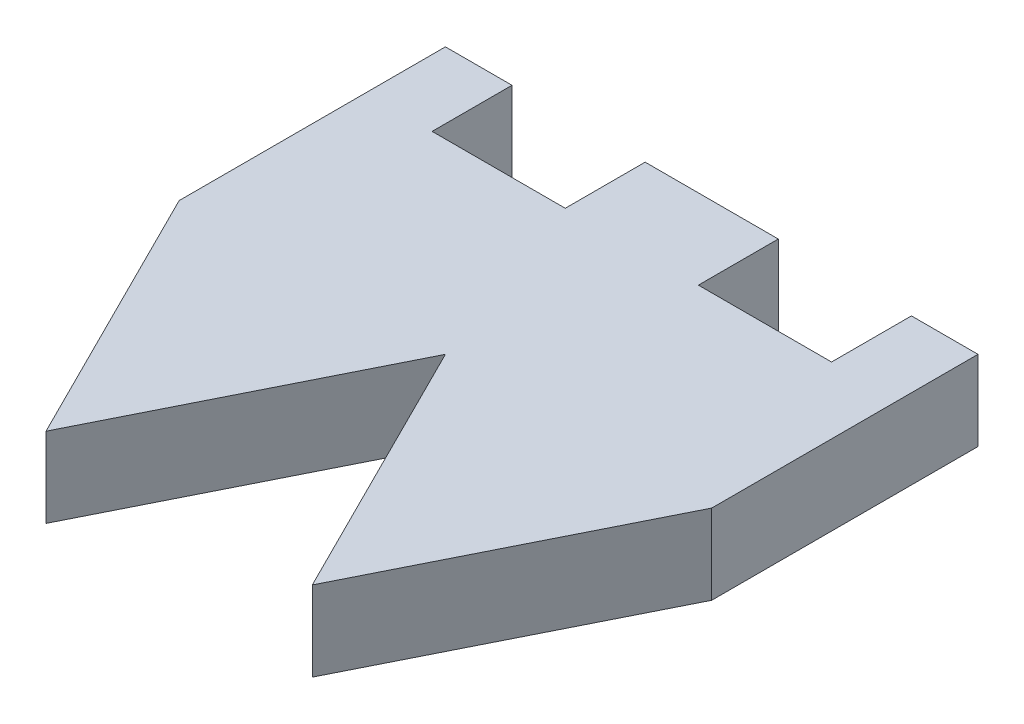
ISO-10303-21;
HEADER;
FILE_DESCRIPTION(('STEP AP214'),'2;1');
FILE_NAME('part.step','',(''),(''),'','','');
FILE_SCHEMA(('AUTOMOTIVE_DESIGN { 1 0 10303 214 1 1 1 1 }'));
ENDSEC;
DATA;
#1=APPLICATION_CONTEXT('core data for automotive mechanical design processes');
#2=APPLICATION_PROTOCOL_DEFINITION('international standard','automotive_design',2000,#1);
#3=PRODUCT_CONTEXT('',#1,'mechanical');
#4=PRODUCT('Part','Part','',(#3));
#5=PRODUCT_RELATED_PRODUCT_CATEGORY('part','',(#4));
#6=PRODUCT_DEFINITION_FORMATION('','',#4);
#7=PRODUCT_DEFINITION_CONTEXT('part definition',#1,'design');
#8=PRODUCT_DEFINITION('design','',#6,#7);
#9=PRODUCT_DEFINITION_SHAPE('','',#8);
#10=(LENGTH_UNIT() NAMED_UNIT(*) SI_UNIT(.MILLI.,.METRE.));
#11=(NAMED_UNIT(*) PLANE_ANGLE_UNIT() SI_UNIT($,.RADIAN.));
#12=(NAMED_UNIT(*) SI_UNIT($,.STERADIAN.) SOLID_ANGLE_UNIT());
#13=UNCERTAINTY_MEASURE_WITH_UNIT(LENGTH_MEASURE(1.E-05),#10,'distance_accuracy_value','');
#14=(GEOMETRIC_REPRESENTATION_CONTEXT(3) GLOBAL_UNCERTAINTY_ASSIGNED_CONTEXT((#13)) GLOBAL_UNIT_ASSIGNED_CONTEXT((#10,
#11,#12)) REPRESENTATION_CONTEXT('',''));
#15=CARTESIAN_POINT('',(0.,0.,0.));
#16=DIRECTION('',(0.,0.,1.));
#17=DIRECTION('',(1.,0.,0.));
#18=AXIS2_PLACEMENT_3D('',#15,#16,#17);
#19=CARTESIAN_POINT('',(0.,3.,0.));
#20=DIRECTION('',(0.,-1.,0.));
#21=DIRECTION('',(0.,0.,-1.));
#22=AXIS2_PLACEMENT_3D('',#19,#20,#21);
#23=PLANE('',#22);
#24=DIRECTION('',(0.,0.,-1.));
#25=VECTOR('',#24,1.);
#26=CARTESIAN_POINT('',(7.49999999999999,3.,0.));
#27=LINE('',#26,#25);
#28=CARTESIAN_POINT('',(7.5,3.,-7.));
#29=VERTEX_POINT('',#28);
#30=CARTESIAN_POINT('',(7.5,3.,-10.));
#31=VERTEX_POINT('',#30);
#32=EDGE_CURVE('E200',#29,#31,#27,.T.);
#33=ORIENTED_EDGE('',*,*,#32,.F.);
#34=DIRECTION('',(1.,0.,0.));
#35=VECTOR('',#34,1.);
#36=CARTESIAN_POINT('',(0.,3.,-7.));
#37=LINE('',#36,#35);
#38=CARTESIAN_POINT('',(2.5,3.,-7.));
#39=VERTEX_POINT('',#38);
#40=EDGE_CURVE('E202',#39,#29,#37,.T.);
#41=ORIENTED_EDGE('',*,*,#40,.F.);
#42=DIRECTION('',(0.,0.,1.));
#43=VECTOR('',#42,1.);
#44=CARTESIAN_POINT('',(2.5,3.,0.));
#45=LINE('',#44,#43);
#46=CARTESIAN_POINT('',(2.5,3.,-10.));
#47=VERTEX_POINT('',#46);
#48=EDGE_CURVE('E188',#47,#39,#45,.T.);
#49=ORIENTED_EDGE('',*,*,#48,.F.);
#50=DIRECTION('',(-1.,0.,0.));
#51=VECTOR('',#50,1.);
#52=CARTESIAN_POINT('',(-10.,3.,-10.));
#53=LINE('',#52,#51);
#54=CARTESIAN_POINT('',(-2.5,3.,-10.));
#55=VERTEX_POINT('',#54);
#56=EDGE_CURVE('E93',#47,#55,#53,.T.);
#57=ORIENTED_EDGE('',*,*,#56,.T.);
#58=DIRECTION('',(0.,0.,1.));
#59=VECTOR('',#58,1.);
#60=CARTESIAN_POINT('',(-2.5,3.,0.));
#61=LINE('',#60,#59);
#62=CARTESIAN_POINT('',(-2.5,3.,-7.));
#63=VERTEX_POINT('',#62);
#64=EDGE_CURVE('E212',#55,#63,#61,.T.);
#65=ORIENTED_EDGE('',*,*,#64,.T.);
#66=DIRECTION('',(-1.,0.,0.));
#67=VECTOR('',#66,1.);
#68=CARTESIAN_POINT('',(0.,3.,-7.));
#69=LINE('',#68,#67);
#70=CARTESIAN_POINT('',(-7.5,3.,-7.));
#71=VERTEX_POINT('',#70);
#72=EDGE_CURVE('E219',#63,#71,#69,.T.);
#73=ORIENTED_EDGE('',*,*,#72,.T.);
#74=DIRECTION('',(0.,0.,-1.));
#75=VECTOR('',#74,1.);
#76=CARTESIAN_POINT('',(-7.49999999999999,3.,0.));
#77=LINE('',#76,#75);
#78=CARTESIAN_POINT('',(-7.5,3.,-10.));
#79=VERTEX_POINT('',#78);
#80=EDGE_CURVE('E216',#71,#79,#77,.T.);
#81=ORIENTED_EDGE('',*,*,#80,.T.);
#82=CARTESIAN_POINT('',(-10.,3.,-10.));
#83=VERTEX_POINT('',#82);
#84=EDGE_CURVE('E270',#79,#83,#53,.T.);
#85=ORIENTED_EDGE('',*,*,#84,.T.);
#86=DIRECTION('',(0.,0.,1.));
#87=VECTOR('',#86,1.);
#88=CARTESIAN_POINT('',(-10.,3.,10.));
#89=LINE('',#88,#87);
#90=CARTESIAN_POINT('',(-10.,3.,0.));
#91=VERTEX_POINT('',#90);
#92=EDGE_CURVE('E274',#83,#91,#89,.T.);
#93=ORIENTED_EDGE('',*,*,#92,.T.);
#94=DIRECTION('',(-0.447213595499958,0.,-0.894427190999916));
#95=VECTOR('',#94,1.);
#96=CARTESIAN_POINT('',(-8.,3.,4.));
#97=LINE('',#96,#95);
#98=CARTESIAN_POINT('',(-5.,3.,10.));
#99=VERTEX_POINT('',#98);
#100=EDGE_CURVE('E255',#99,#91,#97,.T.);
#101=ORIENTED_EDGE('',*,*,#100,.F.);
#102=DIRECTION('',(-0.447213595499958,0.,0.894427190999916));
#103=VECTOR('',#102,1.);
#104=CARTESIAN_POINT('',(0.,3.,0.));
#105=LINE('',#104,#103);
#106=CARTESIAN_POINT('',(0.,3.,0.));
#107=VERTEX_POINT('',#106);
#108=EDGE_CURVE('E229',#107,#99,#105,.T.);
#109=ORIENTED_EDGE('',*,*,#108,.F.);
#110=DIRECTION('',(-0.447213595499958,0.,-0.894427190999916));
#111=VECTOR('',#110,1.);
#112=CARTESIAN_POINT('',(0.,3.,0.));
#113=LINE('',#112,#111);
#114=CARTESIAN_POINT('',(5.,3.,10.));
#115=VERTEX_POINT('',#114);
#116=EDGE_CURVE('E233',#115,#107,#113,.T.);
#117=ORIENTED_EDGE('',*,*,#116,.F.);
#118=DIRECTION('',(-0.447213595499958,0.,0.894427190999916));
#119=VECTOR('',#118,1.);
#120=CARTESIAN_POINT('',(8.,3.,4.));
#121=LINE('',#120,#119);
#122=CARTESIAN_POINT('',(10.,3.000006,0.));
#123=VERTEX_POINT('',#122);
#124=EDGE_CURVE('E244',#123,#115,#121,.T.);
#125=ORIENTED_EDGE('',*,*,#124,.F.);
#126=DIRECTION('',(0.,0.,-1.));
#127=VECTOR('',#126,1.);
#128=CARTESIAN_POINT('',(10.,3.,10.));
#129=LINE('',#128,#127);
#130=CARTESIAN_POINT('',(10.,3.,-10.));
#131=VERTEX_POINT('',#130);
#132=EDGE_CURVE('E267',#123,#131,#129,.T.);
#133=ORIENTED_EDGE('',*,*,#132,.T.);
#134=EDGE_CURVE('E264',#131,#31,#53,.T.);
#135=ORIENTED_EDGE('',*,*,#134,.T.);
#136=EDGE_LOOP('',(#33,#41,#49,#57,#65,#73,#81,#85,#93,#101,#109,#117,#125,#133,#135));
#137=FACE_BOUND('',#136,.T.);
#138=ADVANCED_FACE('F70',(#137),#23,.F.);
#139=CARTESIAN_POINT('',(0.,0.,0.));
#140=DIRECTION('',(0.,-1.,0.));
#141=DIRECTION('',(0.,0.,-1.));
#142=AXIS2_PLACEMENT_3D('',#139,#140,#141);
#143=PLANE('',#142);
#144=DIRECTION('',(1.,0.,0.));
#145=VECTOR('',#144,1.);
#146=CARTESIAN_POINT('',(0.,0.,-7.));
#147=LINE('',#146,#145);
#148=CARTESIAN_POINT('',(2.5,0.,-7.));
#149=VERTEX_POINT('',#148);
#150=CARTESIAN_POINT('',(7.5,0.,-7.));
#151=VERTEX_POINT('',#150);
#152=EDGE_CURVE('E12',#149,#151,#147,.T.);
#153=ORIENTED_EDGE('',*,*,#152,.T.);
#154=DIRECTION('',(0.,0.,-1.));
#155=VECTOR('',#154,1.);
#156=CARTESIAN_POINT('',(7.49999999999999,0.,0.));
#157=LINE('',#156,#155);
#158=CARTESIAN_POINT('',(7.5,0.,-10.));
#159=VERTEX_POINT('',#158);
#160=EDGE_CURVE('E195',#151,#159,#157,.T.);
#161=ORIENTED_EDGE('',*,*,#160,.T.);
#162=DIRECTION('',(-1.,0.,0.));
#163=VECTOR('',#162,1.);
#164=CARTESIAN_POINT('',(-10.,0.,-10.));
#165=LINE('',#164,#163);
#166=CARTESIAN_POINT('',(10.,0.,-10.));
#167=VERTEX_POINT('',#166);
#168=EDGE_CURVE('E284',#167,#159,#165,.T.);
#169=ORIENTED_EDGE('',*,*,#168,.F.);
#170=DIRECTION('',(0.,0.,-1.));
#171=VECTOR('',#170,1.);
#172=CARTESIAN_POINT('',(10.,0.,10.));
#173=LINE('',#172,#171);
#174=CARTESIAN_POINT('',(10.,0.,0.));
#175=VERTEX_POINT('',#174);
#176=EDGE_CURVE('E259',#175,#167,#173,.T.);
#177=ORIENTED_EDGE('',*,*,#176,.F.);
#178=DIRECTION('',(0.447213595499958,0.,-0.894427190999916));
#179=VECTOR('',#178,1.);
#180=CARTESIAN_POINT('',(8.,0.,4.));
#181=LINE('',#180,#179);
#182=CARTESIAN_POINT('',(5.,0.,10.));
#183=VERTEX_POINT('',#182);
#184=EDGE_CURVE('E235',#183,#175,#181,.T.);
#185=ORIENTED_EDGE('',*,*,#184,.F.);
#186=DIRECTION('',(0.447213595499958,0.,0.894427190999916));
#187=VECTOR('',#186,1.);
#188=CARTESIAN_POINT('',(0.,0.,0.));
#189=LINE('',#188,#187);
#190=CARTESIAN_POINT('',(0.,0.,0.));
#191=VERTEX_POINT('',#190);
#192=EDGE_CURVE('E222',#191,#183,#189,.T.);
#193=ORIENTED_EDGE('',*,*,#192,.F.);
#194=DIRECTION('',(0.447213595499958,0.,-0.894427190999916));
#195=VECTOR('',#194,1.);
#196=CARTESIAN_POINT('',(0.,0.,0.));
#197=LINE('',#196,#195);
#198=CARTESIAN_POINT('',(-5.,0.,10.));
#199=VERTEX_POINT('',#198);
#200=EDGE_CURVE('E224',#199,#191,#197,.T.);
#201=ORIENTED_EDGE('',*,*,#200,.F.);
#202=DIRECTION('',(0.447213595499958,0.,0.894427190999916));
#203=VECTOR('',#202,1.);
#204=CARTESIAN_POINT('',(-8.,0.,4.));
#205=LINE('',#204,#203);
#206=CARTESIAN_POINT('',(-10.,0.,0.));
#207=VERTEX_POINT('',#206);
#208=EDGE_CURVE('E236',#207,#199,#205,.T.);
#209=ORIENTED_EDGE('',*,*,#208,.F.);
#210=DIRECTION('',(0.,0.,1.));
#211=VECTOR('',#210,1.);
#212=CARTESIAN_POINT('',(-10.,0.,10.));
#213=LINE('',#212,#211);
#214=CARTESIAN_POINT('',(-10.,0.,-10.));
#215=VERTEX_POINT('',#214);
#216=EDGE_CURVE('E271',#215,#207,#213,.T.);
#217=ORIENTED_EDGE('',*,*,#216,.F.);
#218=CARTESIAN_POINT('',(-7.5,0.,-10.));
#219=VERTEX_POINT('',#218);
#220=EDGE_CURVE('E283',#219,#215,#165,.T.);
#221=ORIENTED_EDGE('',*,*,#220,.F.);
#222=DIRECTION('',(0.,0.,-1.));
#223=VECTOR('',#222,1.);
#224=CARTESIAN_POINT('',(-7.49999999999999,0.,0.));
#225=LINE('',#224,#223);
#226=CARTESIAN_POINT('',(-7.5,0.,-7.));
#227=VERTEX_POINT('',#226);
#228=EDGE_CURVE('E214',#227,#219,#225,.T.);
#229=ORIENTED_EDGE('',*,*,#228,.F.);
#230=DIRECTION('',(-1.,0.,0.));
#231=VECTOR('',#230,1.);
#232=CARTESIAN_POINT('',(0.,0.,-7.));
#233=LINE('',#232,#231);
#234=CARTESIAN_POINT('',(-2.5,0.,-7.));
#235=VERTEX_POINT('',#234);
#236=EDGE_CURVE('E302',#235,#227,#233,.T.);
#237=ORIENTED_EDGE('',*,*,#236,.F.);
#238=DIRECTION('',(0.,0.,1.));
#239=VECTOR('',#238,1.);
#240=CARTESIAN_POINT('',(-2.5,0.,0.));
#241=LINE('',#240,#239);
#242=CARTESIAN_POINT('',(-2.5,0.,-10.));
#243=VERTEX_POINT('',#242);
#244=EDGE_CURVE('E208',#243,#235,#241,.T.);
#245=ORIENTED_EDGE('',*,*,#244,.F.);
#246=CARTESIAN_POINT('',(2.5,0.,-10.));
#247=VERTEX_POINT('',#246);
#248=EDGE_CURVE('E193',#247,#243,#165,.T.);
#249=ORIENTED_EDGE('',*,*,#248,.F.);
#250=DIRECTION('',(0.,0.,1.));
#251=VECTOR('',#250,1.);
#252=CARTESIAN_POINT('',(2.5,0.,0.));
#253=LINE('',#252,#251);
#254=EDGE_CURVE('E85',#247,#149,#253,.T.);
#255=ORIENTED_EDGE('',*,*,#254,.T.);
#256=EDGE_LOOP('',(#153,#161,#169,#177,#185,#193,#201,#209,#217,#221,#229,#237,#245,#249,#255));
#257=FACE_BOUND('',#256,.T.);
#258=ADVANCED_FACE('F191',(#257),#143,.T.);
#259=CARTESIAN_POINT('',(-10.,3.,-10.));
#260=DIRECTION('',(0.,0.,1.));
#261=DIRECTION('',(1.,0.,0.));
#262=AXIS2_PLACEMENT_3D('',#259,#260,#261);
#263=PLANE('',#262);
#264=DIRECTION('',(0.,-1.,0.));
#265=VECTOR('',#264,1.);
#266=CARTESIAN_POINT('',(7.5,3.,-10.));
#267=LINE('',#266,#265);
#268=EDGE_CURVE('E78',#31,#159,#267,.T.);
#269=ORIENTED_EDGE('',*,*,#268,.F.);
#270=ORIENTED_EDGE('',*,*,#134,.F.);
#271=DIRECTION('',(0.,-1.,0.));
#272=VECTOR('',#271,1.);
#273=CARTESIAN_POINT('',(10.,3.,-10.));
#274=LINE('',#273,#272);
#275=EDGE_CURVE('E272',#131,#167,#274,.T.);
#276=ORIENTED_EDGE('',*,*,#275,.T.);
#277=ORIENTED_EDGE('',*,*,#168,.T.);
#278=EDGE_LOOP('',(#269,#270,#276,#277));
#279=FACE_BOUND('',#278,.T.);
#280=ADVANCED_FACE('F316',(#279),#263,.F.);
#281=DIRECTION('',(0.,1.,0.));
#282=VECTOR('',#281,1.);
#283=CARTESIAN_POINT('',(2.5,3.,-10.));
#284=LINE('',#283,#282);
#285=EDGE_CURVE('E306',#247,#47,#284,.T.);
#286=ORIENTED_EDGE('',*,*,#285,.F.);
#287=ORIENTED_EDGE('',*,*,#248,.T.);
#288=DIRECTION('',(0.,1.,0.));
#289=VECTOR('',#288,1.);
#290=CARTESIAN_POINT('',(-2.5,3.,-10.));
#291=LINE('',#290,#289);
#292=EDGE_CURVE('E278',#243,#55,#291,.T.);
#293=ORIENTED_EDGE('',*,*,#292,.T.);
#294=ORIENTED_EDGE('',*,*,#56,.F.);
#295=EDGE_LOOP('',(#286,#287,#293,#294));
#296=FACE_BOUND('',#295,.T.);
#297=ADVANCED_FACE('F318',(#296),#263,.F.);
#298=ORIENTED_EDGE('',*,*,#84,.F.);
#299=DIRECTION('',(0.,-1.,0.));
#300=VECTOR('',#299,1.);
#301=CARTESIAN_POINT('',(-7.5,3.,-10.));
#302=LINE('',#301,#300);
#303=EDGE_CURVE('E298',#79,#219,#302,.T.);
#304=ORIENTED_EDGE('',*,*,#303,.T.);
#305=ORIENTED_EDGE('',*,*,#220,.T.);
#306=DIRECTION('',(0.,-1.,0.));
#307=VECTOR('',#306,1.);
#308=CARTESIAN_POINT('',(-10.,3.,-10.));
#309=LINE('',#308,#307);
#310=EDGE_CURVE('E277',#83,#215,#309,.T.);
#311=ORIENTED_EDGE('',*,*,#310,.F.);
#312=EDGE_LOOP('',(#298,#304,#305,#311));
#313=FACE_BOUND('',#312,.T.);
#314=ADVANCED_FACE('F319',(#313),#263,.F.);
#315=CARTESIAN_POINT('',(10.,3.,10.));
#316=DIRECTION('',(-1.,0.,0.));
#317=DIRECTION('',(0.,0.,1.));
#318=AXIS2_PLACEMENT_3D('',#315,#316,#317);
#319=PLANE('',#318);
#320=DIRECTION('',(0.,1.,0.));
#321=VECTOR('',#320,1.);
#322=CARTESIAN_POINT('',(10.,0.,0.));
#323=LINE('',#322,#321);
#324=EDGE_CURVE('E240',#175,#123,#323,.T.);
#325=ORIENTED_EDGE('',*,*,#324,.F.);
#326=ORIENTED_EDGE('',*,*,#176,.T.);
#327=ORIENTED_EDGE('',*,*,#275,.F.);
#328=ORIENTED_EDGE('',*,*,#132,.F.);
#329=EDGE_LOOP('',(#325,#326,#327,#328));
#330=FACE_BOUND('',#329,.T.);
#331=ADVANCED_FACE('F72',(#330),#319,.F.);
#332=CARTESIAN_POINT('',(-10.,3.,10.));
#333=DIRECTION('',(1.,0.,0.));
#334=DIRECTION('',(0.,0.,-1.));
#335=AXIS2_PLACEMENT_3D('',#332,#333,#334);
#336=PLANE('',#335);
#337=DIRECTION('',(0.,1.,0.));
#338=VECTOR('',#337,1.);
#339=CARTESIAN_POINT('',(-10.,0.,0.));
#340=LINE('',#339,#338);
#341=EDGE_CURVE('E239',#207,#91,#340,.T.);
#342=ORIENTED_EDGE('',*,*,#341,.T.);
#343=ORIENTED_EDGE('',*,*,#92,.F.);
#344=ORIENTED_EDGE('',*,*,#310,.T.);
#345=ORIENTED_EDGE('',*,*,#216,.T.);
#346=EDGE_LOOP('',(#342,#343,#344,#345));
#347=FACE_BOUND('',#346,.T.);
#348=ADVANCED_FACE('F335',(#347),#336,.F.);
#349=CARTESIAN_POINT('',(8.,0.,4.));
#350=DIRECTION('',(0.894427190999916,0.,0.447213595499958));
#351=DIRECTION('',(0.447213595499958,0.,-0.894427190999916));
#352=AXIS2_PLACEMENT_3D('',#349,#350,#351);
#353=PLANE('',#352);
#354=ORIENTED_EDGE('',*,*,#124,.T.);
#355=DIRECTION('',(0.,1.,0.));
#356=VECTOR('',#355,1.);
#357=CARTESIAN_POINT('',(5.,0.,10.));
#358=LINE('',#357,#356);
#359=EDGE_CURVE('E227',#183,#115,#358,.T.);
#360=ORIENTED_EDGE('',*,*,#359,.F.);
#361=ORIENTED_EDGE('',*,*,#184,.T.);
#362=ORIENTED_EDGE('',*,*,#324,.T.);
#363=EDGE_LOOP('',(#354,#360,#361,#362));
#364=FACE_BOUND('',#363,.T.);
#365=ADVANCED_FACE('F333',(#364),#353,.T.);
#366=CARTESIAN_POINT('',(-8.,0.,4.));
#367=DIRECTION('',(-0.894427190999916,0.,0.447213595499958));
#368=DIRECTION('',(0.447213595499958,0.,0.894427190999916));
#369=AXIS2_PLACEMENT_3D('',#366,#367,#368);
#370=PLANE('',#369);
#371=ORIENTED_EDGE('',*,*,#100,.T.);
#372=ORIENTED_EDGE('',*,*,#341,.F.);
#373=ORIENTED_EDGE('',*,*,#208,.T.);
#374=DIRECTION('',(0.,1.,0.));
#375=VECTOR('',#374,1.);
#376=CARTESIAN_POINT('',(-5.,0.,10.));
#377=LINE('',#376,#375);
#378=EDGE_CURVE('E241',#199,#99,#377,.T.);
#379=ORIENTED_EDGE('',*,*,#378,.T.);
#380=EDGE_LOOP('',(#371,#372,#373,#379));
#381=FACE_BOUND('',#380,.T.);
#382=ADVANCED_FACE('F341',(#381),#370,.T.);
#383=CARTESIAN_POINT('',(0.,0.,0.));
#384=DIRECTION('',(-0.894427190999916,0.,0.447213595499958));
#385=DIRECTION('',(0.447213595499958,0.,0.894427190999916));
#386=AXIS2_PLACEMENT_3D('',#383,#384,#385);
#387=PLANE('',#386);
#388=ORIENTED_EDGE('',*,*,#116,.T.);
#389=DIRECTION('',(0.,1.,0.));
#390=VECTOR('',#389,1.);
#391=CARTESIAN_POINT('',(0.,0.,0.));
#392=LINE('',#391,#390);
#393=EDGE_CURVE('E226',#191,#107,#392,.T.);
#394=ORIENTED_EDGE('',*,*,#393,.F.);
#395=ORIENTED_EDGE('',*,*,#192,.T.);
#396=ORIENTED_EDGE('',*,*,#359,.T.);
#397=EDGE_LOOP('',(#388,#394,#395,#396));
#398=FACE_BOUND('',#397,.T.);
#399=ADVANCED_FACE('F370',(#398),#387,.T.);
#400=CARTESIAN_POINT('',(0.,0.,0.));
#401=DIRECTION('',(0.894427190999916,0.,0.447213595499958));
#402=DIRECTION('',(0.447213595499958,0.,-0.894427190999916));
#403=AXIS2_PLACEMENT_3D('',#400,#401,#402);
#404=PLANE('',#403);
#405=ORIENTED_EDGE('',*,*,#108,.T.);
#406=ORIENTED_EDGE('',*,*,#378,.F.);
#407=ORIENTED_EDGE('',*,*,#200,.T.);
#408=ORIENTED_EDGE('',*,*,#393,.T.);
#409=EDGE_LOOP('',(#405,#406,#407,#408));
#410=FACE_BOUND('',#409,.T.);
#411=ADVANCED_FACE('F365',(#410),#404,.T.);
#412=CARTESIAN_POINT('',(-7.5,-2.49999999998515E-05,-7.));
#413=DIRECTION('',(0.,0.,1.));
#414=DIRECTION('',(1.,0.,0.));
#415=AXIS2_PLACEMENT_3D('',#412,#413,#414);
#416=PLANE('',#415);
#417=DIRECTION('',(0.,1.,0.));
#418=VECTOR('',#417,1.);
#419=CARTESIAN_POINT('',(-2.5,-2.49999999998515E-05,-7.));
#420=LINE('',#419,#418);
#421=EDGE_CURVE('E205',#235,#63,#420,.T.);
#422=ORIENTED_EDGE('',*,*,#421,.F.);
#423=ORIENTED_EDGE('',*,*,#236,.T.);
#424=DIRECTION('',(0.,1.,0.));
#425=VECTOR('',#424,1.);
#426=CARTESIAN_POINT('',(-7.5,-2.49999999998515E-05,-7.));
#427=LINE('',#426,#425);
#428=EDGE_CURVE('E204',#227,#71,#427,.T.);
#429=ORIENTED_EDGE('',*,*,#428,.T.);
#430=ORIENTED_EDGE('',*,*,#72,.F.);
#431=EDGE_LOOP('',(#422,#423,#429,#430));
#432=FACE_BOUND('',#431,.T.);
#433=ADVANCED_FACE('F355',(#432),#416,.F.);
#434=CARTESIAN_POINT('',(-7.5,-2.49999999998515E-05,-10.));
#435=DIRECTION('',(-1.,0.,0.));
#436=DIRECTION('',(0.,0.,1.));
#437=AXIS2_PLACEMENT_3D('',#434,#435,#436);
#438=PLANE('',#437);
#439=ORIENTED_EDGE('',*,*,#428,.F.);
#440=ORIENTED_EDGE('',*,*,#228,.T.);
#441=ORIENTED_EDGE('',*,*,#303,.F.);
#442=ORIENTED_EDGE('',*,*,#80,.F.);
#443=EDGE_LOOP('',(#439,#440,#441,#442));
#444=FACE_BOUND('',#443,.T.);
#445=ADVANCED_FACE('F357',(#444),#438,.F.);
#446=CARTESIAN_POINT('',(-2.5,-2.49999999998515E-05,-10.));
#447=DIRECTION('',(1.,0.,0.));
#448=DIRECTION('',(0.,0.,-1.));
#449=AXIS2_PLACEMENT_3D('',#446,#447,#448);
#450=PLANE('',#449);
#451=ORIENTED_EDGE('',*,*,#292,.F.);
#452=ORIENTED_EDGE('',*,*,#244,.T.);
#453=ORIENTED_EDGE('',*,*,#421,.T.);
#454=ORIENTED_EDGE('',*,*,#64,.F.);
#455=EDGE_LOOP('',(#451,#452,#453,#454));
#456=FACE_BOUND('',#455,.T.);
#457=ADVANCED_FACE('F350',(#456),#450,.F.);
#458=CARTESIAN_POINT('',(7.5,-2.49999999998515E-05,-7.));
#459=DIRECTION('',(0.,0.,-1.));
#460=DIRECTION('',(-1.,0.,0.));
#461=AXIS2_PLACEMENT_3D('',#458,#459,#460);
#462=PLANE('',#461);
#463=ORIENTED_EDGE('',*,*,#40,.T.);
#464=DIRECTION('',(0.,1.,0.));
#465=VECTOR('',#464,1.);
#466=CARTESIAN_POINT('',(7.5,-2.49999999998515E-05,-7.));
#467=LINE('',#466,#465);
#468=EDGE_CURVE('E184',#151,#29,#467,.T.);
#469=ORIENTED_EDGE('',*,*,#468,.F.);
#470=ORIENTED_EDGE('',*,*,#152,.F.);
#471=DIRECTION('',(0.,1.,0.));
#472=VECTOR('',#471,1.);
#473=CARTESIAN_POINT('',(2.5,-2.49999999998515E-05,-7.));
#474=LINE('',#473,#472);
#475=EDGE_CURVE('E181',#149,#39,#474,.T.);
#476=ORIENTED_EDGE('',*,*,#475,.T.);
#477=EDGE_LOOP('',(#463,#469,#470,#476));
#478=FACE_BOUND('',#477,.T.);
#479=ADVANCED_FACE('F180',(#478),#462,.T.);
#480=CARTESIAN_POINT('',(7.5,-2.49999999998515E-05,-10.));
#481=DIRECTION('',(-1.,0.,0.));
#482=DIRECTION('',(0.,0.,1.));
#483=AXIS2_PLACEMENT_3D('',#480,#481,#482);
#484=PLANE('',#483);
#485=ORIENTED_EDGE('',*,*,#32,.T.);
#486=ORIENTED_EDGE('',*,*,#268,.T.);
#487=ORIENTED_EDGE('',*,*,#160,.F.);
#488=ORIENTED_EDGE('',*,*,#468,.T.);
#489=EDGE_LOOP('',(#485,#486,#487,#488));
#490=FACE_BOUND('',#489,.T.);
#491=ADVANCED_FACE('F311',(#490),#484,.T.);
#492=CARTESIAN_POINT('',(2.5,-2.49999999998515E-05,-10.));
#493=DIRECTION('',(1.,0.,0.));
#494=DIRECTION('',(0.,0.,-1.));
#495=AXIS2_PLACEMENT_3D('',#492,#493,#494);
#496=PLANE('',#495);
#497=ORIENTED_EDGE('',*,*,#48,.T.);
#498=ORIENTED_EDGE('',*,*,#475,.F.);
#499=ORIENTED_EDGE('',*,*,#254,.F.);
#500=ORIENTED_EDGE('',*,*,#285,.T.);
#501=EDGE_LOOP('',(#497,#498,#499,#500));
#502=FACE_BOUND('',#501,.T.);
#503=ADVANCED_FACE('F187',(#502),#496,.T.);
#504=CLOSED_SHELL('',(#138,#258,#280,#297,#314,#331,#348,#365,#382,#399,#411,#433,#445,#457,
#479,#491,#503));
#505=MANIFOLD_SOLID_BREP('B2',#504);
#506=ADVANCED_BREP_SHAPE_REPRESENTATION('',(#18,#505),#14);
#507=SHAPE_DEFINITION_REPRESENTATION(#9,#506);
ENDSEC;
END-ISO-10303-21;
